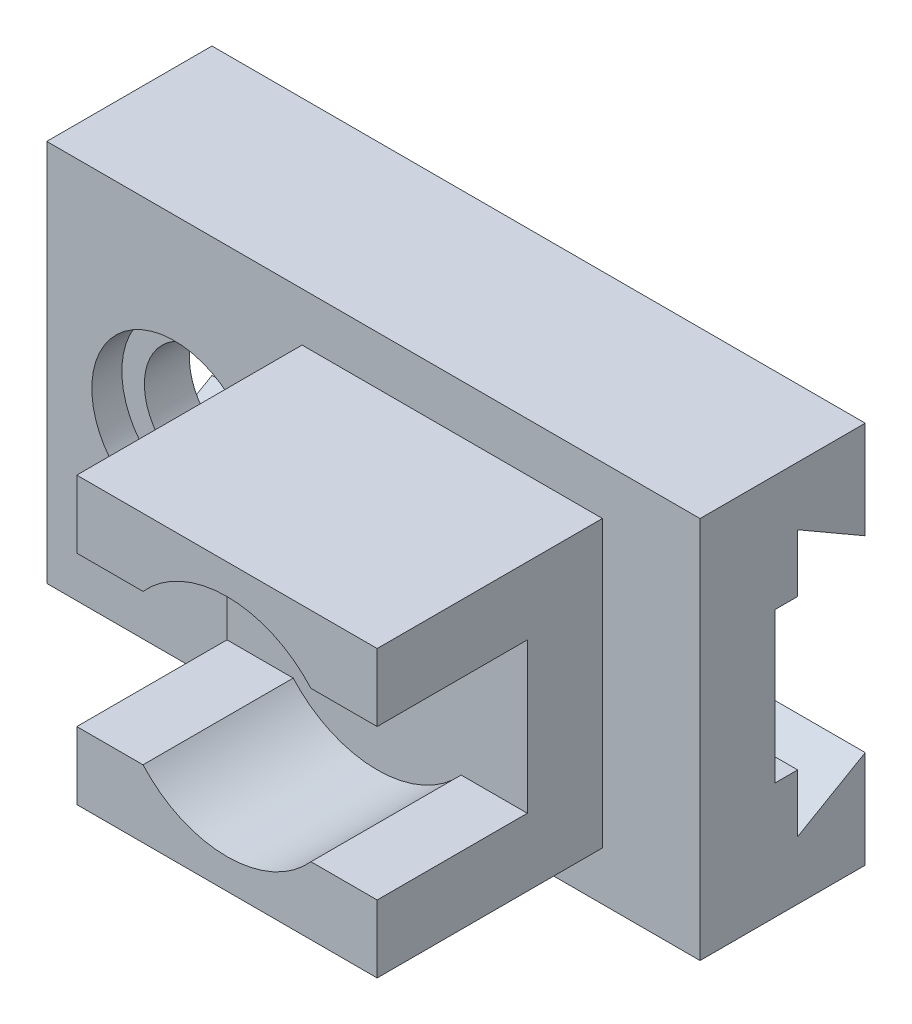
ISO-10303-21;
HEADER;
FILE_DESCRIPTION(('STEP AP214'),'2;1');
FILE_NAME('part.step','',(''),(''),'','','');
FILE_SCHEMA(('AUTOMOTIVE_DESIGN { 1 0 10303 214 1 1 1 1 }'));
ENDSEC;
DATA;
#1=APPLICATION_CONTEXT('core data for automotive mechanical design processes');
#2=APPLICATION_PROTOCOL_DEFINITION('international standard','automotive_design',2000,#1);
#3=PRODUCT_CONTEXT('',#1,'mechanical');
#4=PRODUCT('Part','Part','',(#3));
#5=PRODUCT_RELATED_PRODUCT_CATEGORY('part','',(#4));
#6=PRODUCT_DEFINITION_FORMATION('','',#4);
#7=PRODUCT_DEFINITION_CONTEXT('part definition',#1,'design');
#8=PRODUCT_DEFINITION('design','',#6,#7);
#9=PRODUCT_DEFINITION_SHAPE('','',#8);
#10=(LENGTH_UNIT() NAMED_UNIT(*) SI_UNIT(.MILLI.,.METRE.));
#11=(NAMED_UNIT(*) PLANE_ANGLE_UNIT() SI_UNIT($,.RADIAN.));
#12=(NAMED_UNIT(*) SI_UNIT($,.STERADIAN.) SOLID_ANGLE_UNIT());
#13=UNCERTAINTY_MEASURE_WITH_UNIT(LENGTH_MEASURE(1.E-05),#10,'distance_accuracy_value','');
#14=(GEOMETRIC_REPRESENTATION_CONTEXT(3) GLOBAL_UNCERTAINTY_ASSIGNED_CONTEXT((#13)) GLOBAL_UNIT_ASSIGNED_CONTEXT((#10,
#11,#12)) REPRESENTATION_CONTEXT('',''));
#15=CARTESIAN_POINT('',(0.,0.,0.));
#16=DIRECTION('',(0.,0.,1.));
#17=DIRECTION('',(1.,0.,0.));
#18=AXIS2_PLACEMENT_3D('',#15,#16,#17);
#19=CARTESIAN_POINT('',(0.,0.,-22.));
#20=DIRECTION('',(0.,0.,1.));
#21=DIRECTION('',(1.,0.,0.));
#22=AXIS2_PLACEMENT_3D('',#19,#20,#21);
#23=PLANE('',#22);
#24=DIRECTION('',(0.,-1.,0.));
#25=VECTOR('',#24,1.);
#26=CARTESIAN_POINT('',(-43.5,25.491,-22.));
#27=LINE('',#26,#25);
#28=CARTESIAN_POINT('',(-43.5,-12.5,-22.));
#29=VERTEX_POINT('',#28);
#30=CARTESIAN_POINT('',(-43.5,-25.491,-22.));
#31=VERTEX_POINT('',#30);
#32=EDGE_CURVE('E391',#29,#31,#27,.T.);
#33=ORIENTED_EDGE('',*,*,#32,.F.);
#34=DIRECTION('',(-1.,0.,0.));
#35=VECTOR('',#34,1.);
#36=CARTESIAN_POINT('',(43.5,-12.5,-22.));
#37=LINE('',#36,#35);
#38=CARTESIAN_POINT('',(43.5,-12.5,-22.));
#39=VERTEX_POINT('',#38);
#40=EDGE_CURVE('E292',#39,#29,#37,.T.);
#41=ORIENTED_EDGE('',*,*,#40,.F.);
#42=DIRECTION('',(0.,1.,0.));
#43=VECTOR('',#42,1.);
#44=CARTESIAN_POINT('',(43.5,-25.491,-22.));
#45=LINE('',#44,#43);
#46=CARTESIAN_POINT('',(43.5,-25.491,-22.));
#47=VERTEX_POINT('',#46);
#48=EDGE_CURVE('E400',#47,#39,#45,.T.);
#49=ORIENTED_EDGE('',*,*,#48,.F.);
#50=DIRECTION('',(1.,0.,0.));
#51=VECTOR('',#50,1.);
#52=CARTESIAN_POINT('',(-43.5,-25.491,-22.));
#53=LINE('',#52,#51);
#54=EDGE_CURVE('E396',#31,#47,#53,.T.);
#55=ORIENTED_EDGE('',*,*,#54,.F.);
#56=EDGE_LOOP('',(#33,#41,#49,#55));
#57=FACE_BOUND('',#56,.T.);
#58=ADVANCED_FACE('F69',(#57),#23,.F.);
#59=CARTESIAN_POINT('',(30.5,-19.,30.));
#60=DIRECTION('',(-1.,0.,0.));
#61=DIRECTION('',(0.,0.,1.));
#62=AXIS2_PLACEMENT_3D('',#59,#60,#61);
#63=PLANE('',#62);
#64=DIRECTION('',(0.,0.,1.));
#65=VECTOR('',#64,1.);
#66=CARTESIAN_POINT('',(30.5,9.99999999999999,10.));
#67=LINE('',#66,#65);
#68=CARTESIAN_POINT('',(30.5,9.99999999999999,10.));
#69=VERTEX_POINT('',#68);
#70=CARTESIAN_POINT('',(30.5,9.99999999999999,30.));
#71=VERTEX_POINT('',#70);
#72=EDGE_CURVE('E314',#69,#71,#67,.T.);
#73=ORIENTED_EDGE('',*,*,#72,.F.);
#74=DIRECTION('',(0.,1.,0.));
#75=VECTOR('',#74,1.);
#76=CARTESIAN_POINT('',(30.5,-9.99999999999999,10.));
#77=LINE('',#76,#75);
#78=CARTESIAN_POINT('',(30.5,-9.99999999999999,10.));
#79=VERTEX_POINT('',#78);
#80=EDGE_CURVE('E320',#79,#69,#77,.T.);
#81=ORIENTED_EDGE('',*,*,#80,.F.);
#82=DIRECTION('',(0.,0.,1.));
#83=VECTOR('',#82,1.);
#84=CARTESIAN_POINT('',(30.5,-9.99999999999999,10.));
#85=LINE('',#84,#83);
#86=CARTESIAN_POINT('',(30.5,-9.99999999999999,30.));
#87=VERTEX_POINT('',#86);
#88=EDGE_CURVE('E344',#79,#87,#85,.T.);
#89=ORIENTED_EDGE('',*,*,#88,.T.);
#90=DIRECTION('',(0.,1.,0.));
#91=VECTOR('',#90,1.);
#92=CARTESIAN_POINT('',(30.5,-19.,30.));
#93=LINE('',#92,#91);
#94=CARTESIAN_POINT('',(30.5,-19.,30.));
#95=VERTEX_POINT('',#94);
#96=EDGE_CURVE('E359',#95,#87,#93,.T.);
#97=ORIENTED_EDGE('',*,*,#96,.F.);
#98=DIRECTION('',(0.,0.,-1.));
#99=VECTOR('',#98,1.);
#100=CARTESIAN_POINT('',(30.5,-19.,30.));
#101=LINE('',#100,#99);
#102=CARTESIAN_POINT('',(30.5,-19.,0.));
#103=VERTEX_POINT('',#102);
#104=EDGE_CURVE('E373',#95,#103,#101,.T.);
#105=ORIENTED_EDGE('',*,*,#104,.T.);
#106=DIRECTION('',(0.,1.,0.));
#107=VECTOR('',#106,1.);
#108=CARTESIAN_POINT('',(30.5,-19.,0.));
#109=LINE('',#108,#107);
#110=CARTESIAN_POINT('',(30.5,19.,0.));
#111=VERTEX_POINT('',#110);
#112=EDGE_CURVE('E352',#103,#111,#109,.T.);
#113=ORIENTED_EDGE('',*,*,#112,.T.);
#114=DIRECTION('',(0.,0.,-1.));
#115=VECTOR('',#114,1.);
#116=CARTESIAN_POINT('',(30.5,19.,30.));
#117=LINE('',#116,#115);
#118=CARTESIAN_POINT('',(30.5,19.,30.));
#119=VERTEX_POINT('',#118);
#120=EDGE_CURVE('E362',#119,#111,#117,.T.);
#121=ORIENTED_EDGE('',*,*,#120,.F.);
#122=EDGE_CURVE('E358',#71,#119,#93,.T.);
#123=ORIENTED_EDGE('',*,*,#122,.F.);
#124=EDGE_LOOP('',(#73,#81,#89,#97,#105,#113,#121,#123));
#125=FACE_BOUND('',#124,.T.);
#126=ADVANCED_FACE('F481',(#125),#63,.F.);
#127=CARTESIAN_POINT('',(0.,0.,30.));
#128=DIRECTION('',(0.,0.,1.));
#129=DIRECTION('',(1.,0.,0.));
#130=AXIS2_PLACEMENT_3D('',#127,#128,#129);
#131=PLANE('',#130);
#132=CARTESIAN_POINT('',(10.5,0.,30.));
#133=DIRECTION('',(0.,0.,1.));
#134=DIRECTION('',(1.,0.,0.));
#135=AXIS2_PLACEMENT_3D('',#132,#133,#134);
#136=CIRCLE('',#135,15.);
#137=CARTESIAN_POINT('',(21.680339887499,9.99999999999999,30.));
#138=VERTEX_POINT('',#137);
#139=CARTESIAN_POINT('',(-0.680339887498955,9.99999999999999,30.));
#140=VERTEX_POINT('',#139);
#141=EDGE_CURVE('E94',#138,#140,#136,.T.);
#142=ORIENTED_EDGE('',*,*,#141,.F.);
#143=DIRECTION('',(1.,0.,0.));
#144=VECTOR('',#143,1.);
#145=CARTESIAN_POINT('',(-9.5,9.99999999999999,30.));
#146=LINE('',#145,#144);
#147=EDGE_CURVE('E336',#138,#71,#146,.T.);
#148=ORIENTED_EDGE('',*,*,#147,.T.);
#149=ORIENTED_EDGE('',*,*,#122,.T.);
#150=DIRECTION('',(-1.,0.,0.));
#151=VECTOR('',#150,1.);
#152=CARTESIAN_POINT('',(30.5,19.,30.));
#153=LINE('',#152,#151);
#154=CARTESIAN_POINT('',(-9.5,19.,30.));
#155=VERTEX_POINT('',#154);
#156=EDGE_CURVE('E348',#119,#155,#153,.T.);
#157=ORIENTED_EDGE('',*,*,#156,.T.);
#158=DIRECTION('',(0.,-1.,0.));
#159=VECTOR('',#158,1.);
#160=CARTESIAN_POINT('',(-9.5,19.,30.));
#161=LINE('',#160,#159);
#162=CARTESIAN_POINT('',(-9.5,9.99999999999999,30.));
#163=VERTEX_POINT('',#162);
#164=EDGE_CURVE('E353',#155,#163,#161,.T.);
#165=ORIENTED_EDGE('',*,*,#164,.T.);
#166=EDGE_CURVE('E332',#163,#140,#146,.T.);
#167=ORIENTED_EDGE('',*,*,#166,.T.);
#168=EDGE_LOOP('',(#142,#148,#149,#157,#165,#167));
#169=FACE_BOUND('',#168,.T.);
#170=ADVANCED_FACE('F438',(#169),#131,.T.);
#171=CARTESIAN_POINT('',(0.,0.,0.));
#172=DIRECTION('',(0.,0.,1.));
#173=DIRECTION('',(1.,0.,0.));
#174=AXIS2_PLACEMENT_3D('',#171,#172,#173);
#175=PLANE('',#174);
#176=CARTESIAN_POINT('',(-26.5,0.,0.));
#177=DIRECTION('',(0.,0.,1.));
#178=DIRECTION('',(1.,0.,0.));
#179=AXIS2_PLACEMENT_3D('',#176,#177,#178);
#180=CIRCLE('',#179,11.);
#181=CARTESIAN_POINT('',(-15.5,0.,0.));
#182=VERTEX_POINT('',#181);
#183=EDGE_CURVE('E385',#182,#182,#180,.T.);
#184=ORIENTED_EDGE('',*,*,#183,.F.);
#185=EDGE_LOOP('',(#184));
#186=FACE_BOUND('',#185,.T.);
#187=DIRECTION('',(-1.,0.,0.));
#188=VECTOR('',#187,1.);
#189=CARTESIAN_POINT('',(43.5,25.491,0.));
#190=LINE('',#189,#188);
#191=CARTESIAN_POINT('',(43.5,25.491,0.));
#192=VERTEX_POINT('',#191);
#193=CARTESIAN_POINT('',(-43.5,25.491,0.));
#194=VERTEX_POINT('',#193);
#195=EDGE_CURVE('E384',#192,#194,#190,.T.);
#196=ORIENTED_EDGE('',*,*,#195,.T.);
#197=DIRECTION('',(0.,-1.,0.));
#198=VECTOR('',#197,1.);
#199=CARTESIAN_POINT('',(-43.5,25.491,0.));
#200=LINE('',#199,#198);
#201=CARTESIAN_POINT('',(-43.5,-25.491,0.));
#202=VERTEX_POINT('',#201);
#203=EDGE_CURVE('E406',#194,#202,#200,.T.);
#204=ORIENTED_EDGE('',*,*,#203,.T.);
#205=DIRECTION('',(1.,0.,0.));
#206=VECTOR('',#205,1.);
#207=CARTESIAN_POINT('',(-43.5,-25.491,0.));
#208=LINE('',#207,#206);
#209=CARTESIAN_POINT('',(43.5,-25.491,0.));
#210=VERTEX_POINT('',#209);
#211=EDGE_CURVE('E409',#202,#210,#208,.T.);
#212=ORIENTED_EDGE('',*,*,#211,.T.);
#213=DIRECTION('',(0.,1.,0.));
#214=VECTOR('',#213,1.);
#215=CARTESIAN_POINT('',(43.5,-25.491,0.));
#216=LINE('',#215,#214);
#217=EDGE_CURVE('E392',#210,#192,#216,.T.);
#218=ORIENTED_EDGE('',*,*,#217,.T.);
#219=EDGE_LOOP('',(#196,#204,#212,#218));
#220=FACE_BOUND('',#219,.T.);
#221=DIRECTION('',(0.,-1.,0.));
#222=VECTOR('',#221,1.);
#223=CARTESIAN_POINT('',(-9.5,19.,0.));
#224=LINE('',#223,#222);
#225=CARTESIAN_POINT('',(-9.5,19.,0.));
#226=VERTEX_POINT('',#225);
#227=CARTESIAN_POINT('',(-9.5,-19.,0.));
#228=VERTEX_POINT('',#227);
#229=EDGE_CURVE('E365',#226,#228,#224,.T.);
#230=ORIENTED_EDGE('',*,*,#229,.F.);
#231=DIRECTION('',(-1.,0.,0.));
#232=VECTOR('',#231,1.);
#233=CARTESIAN_POINT('',(30.5,19.,0.));
#234=LINE('',#233,#232);
#235=EDGE_CURVE('E305',#111,#226,#234,.T.);
#236=ORIENTED_EDGE('',*,*,#235,.F.);
#237=ORIENTED_EDGE('',*,*,#112,.F.);
#238=DIRECTION('',(1.,0.,0.));
#239=VECTOR('',#238,1.);
#240=CARTESIAN_POINT('',(-9.5,-19.,0.));
#241=LINE('',#240,#239);
#242=EDGE_CURVE('E367',#228,#103,#241,.T.);
#243=ORIENTED_EDGE('',*,*,#242,.F.);
#244=EDGE_LOOP('',(#230,#236,#237,#243));
#245=FACE_BOUND('',#244,.T.);
#246=ADVANCED_FACE('F435',(#186,#220,#245),#175,.T.);
#247=CARTESIAN_POINT('',(43.5,25.491,-22.));
#248=DIRECTION('',(0.,1.,0.));
#249=DIRECTION('',(-1.,0.,0.));
#250=AXIS2_PLACEMENT_3D('',#247,#248,#249);
#251=PLANE('',#250);
#252=ORIENTED_EDGE('',*,*,#195,.F.);
#253=DIRECTION('',(0.,0.,1.));
#254=VECTOR('',#253,1.);
#255=CARTESIAN_POINT('',(43.5,25.491,-22.));
#256=LINE('',#255,#254);
#257=CARTESIAN_POINT('',(43.5,25.491,-22.));
#258=VERTEX_POINT('',#257);
#259=EDGE_CURVE('E12',#258,#192,#256,.T.);
#260=ORIENTED_EDGE('',*,*,#259,.F.);
#261=DIRECTION('',(-1.,0.,0.));
#262=VECTOR('',#261,1.);
#263=CARTESIAN_POINT('',(43.5,25.491,-22.));
#264=LINE('',#263,#262);
#265=CARTESIAN_POINT('',(-43.5,25.491,-22.));
#266=VERTEX_POINT('',#265);
#267=EDGE_CURVE('E388',#258,#266,#264,.T.);
#268=ORIENTED_EDGE('',*,*,#267,.T.);
#269=DIRECTION('',(0.,0.,1.));
#270=VECTOR('',#269,1.);
#271=CARTESIAN_POINT('',(-43.5,25.491,-22.));
#272=LINE('',#271,#270);
#273=EDGE_CURVE('E403',#266,#194,#272,.T.);
#274=ORIENTED_EDGE('',*,*,#273,.T.);
#275=EDGE_LOOP('',(#252,#260,#268,#274));
#276=FACE_BOUND('',#275,.T.);
#277=ADVANCED_FACE('F71',(#276),#251,.T.);
#278=CARTESIAN_POINT('',(43.5,-25.491,-22.));
#279=DIRECTION('',(1.,0.,0.));
#280=DIRECTION('',(0.,1.,0.));
#281=AXIS2_PLACEMENT_3D('',#278,#279,#280);
#282=PLANE('',#281);
#283=DIRECTION('',(0.,-0.500000000000002,0.866025403784438));
#284=VECTOR('',#283,1.);
#285=CARTESIAN_POINT('',(43.5,-17.6961524227067,-13.));
#286=LINE('',#285,#284);
#287=CARTESIAN_POINT('',(43.5,-17.6961524227067,-13.));
#288=VERTEX_POINT('',#287);
#289=EDGE_CURVE('E264',#39,#288,#286,.T.);
#290=ORIENTED_EDGE('',*,*,#289,.T.);
#291=DIRECTION('',(0.,1.,0.));
#292=VECTOR('',#291,1.);
#293=CARTESIAN_POINT('',(43.5,-10.,-13.));
#294=LINE('',#293,#292);
#295=CARTESIAN_POINT('',(43.5,-10.,-13.));
#296=VERTEX_POINT('',#295);
#297=EDGE_CURVE('E266',#288,#296,#294,.T.);
#298=ORIENTED_EDGE('',*,*,#297,.T.);
#299=DIRECTION('',(0.,0.,1.));
#300=VECTOR('',#299,1.);
#301=CARTESIAN_POINT('',(43.5,-10.,-10.));
#302=LINE('',#301,#300);
#303=CARTESIAN_POINT('',(43.5,-10.,-10.));
#304=VERTEX_POINT('',#303);
#305=EDGE_CURVE('E269',#296,#304,#302,.T.);
#306=ORIENTED_EDGE('',*,*,#305,.T.);
#307=DIRECTION('',(0.,1.,0.));
#308=VECTOR('',#307,1.);
#309=CARTESIAN_POINT('',(43.5,10.,-10.));
#310=LINE('',#309,#308);
#311=CARTESIAN_POINT('',(43.5,10.,-10.));
#312=VERTEX_POINT('',#311);
#313=EDGE_CURVE('E243',#304,#312,#310,.T.);
#314=ORIENTED_EDGE('',*,*,#313,.T.);
#315=DIRECTION('',(0.,0.,-1.));
#316=VECTOR('',#315,1.);
#317=CARTESIAN_POINT('',(43.5,10.,-10.));
#318=LINE('',#317,#316);
#319=CARTESIAN_POINT('',(43.5,10.,-13.));
#320=VERTEX_POINT('',#319);
#321=EDGE_CURVE('E235',#312,#320,#318,.T.);
#322=ORIENTED_EDGE('',*,*,#321,.T.);
#323=DIRECTION('',(0.,1.,0.));
#324=VECTOR('',#323,1.);
#325=CARTESIAN_POINT('',(43.5,10.,-13.));
#326=LINE('',#325,#324);
#327=CARTESIAN_POINT('',(43.5,17.6961524227067,-13.));
#328=VERTEX_POINT('',#327);
#329=EDGE_CURVE('E246',#320,#328,#326,.T.);
#330=ORIENTED_EDGE('',*,*,#329,.T.);
#331=DIRECTION('',(0.,-0.500000000000002,-0.866025403784438));
#332=VECTOR('',#331,1.);
#333=CARTESIAN_POINT('',(43.5,17.6961524227067,-13.));
#334=LINE('',#333,#332);
#335=CARTESIAN_POINT('',(43.5,12.5,-22.));
#336=VERTEX_POINT('',#335);
#337=EDGE_CURVE('E251',#328,#336,#334,.T.);
#338=ORIENTED_EDGE('',*,*,#337,.T.);
#339=EDGE_CURVE('E399',#336,#258,#45,.T.);
#340=ORIENTED_EDGE('',*,*,#339,.T.);
#341=ORIENTED_EDGE('',*,*,#259,.T.);
#342=ORIENTED_EDGE('',*,*,#217,.F.);
#343=DIRECTION('',(0.,0.,1.));
#344=VECTOR('',#343,1.);
#345=CARTESIAN_POINT('',(43.5,-25.491,-22.));
#346=LINE('',#345,#344);
#347=EDGE_CURVE('E78',#47,#210,#346,.T.);
#348=ORIENTED_EDGE('',*,*,#347,.F.);
#349=ORIENTED_EDGE('',*,*,#48,.T.);
#350=EDGE_LOOP('',(#290,#298,#306,#314,#322,#330,#338,#340,#341,#342,#348,#349));
#351=FACE_BOUND('',#350,.T.);
#352=ADVANCED_FACE('F254',(#351),#282,.T.);
#353=CARTESIAN_POINT('',(-43.5,-25.491,-22.));
#354=DIRECTION('',(0.,-1.,0.));
#355=DIRECTION('',(1.,0.,0.));
#356=AXIS2_PLACEMENT_3D('',#353,#354,#355);
#357=PLANE('',#356);
#358=ORIENTED_EDGE('',*,*,#211,.F.);
#359=DIRECTION('',(0.,0.,1.));
#360=VECTOR('',#359,1.);
#361=CARTESIAN_POINT('',(-43.5,-25.491,-22.));
#362=LINE('',#361,#360);
#363=EDGE_CURVE('E415',#31,#202,#362,.T.);
#364=ORIENTED_EDGE('',*,*,#363,.F.);
#365=ORIENTED_EDGE('',*,*,#54,.T.);
#366=ORIENTED_EDGE('',*,*,#347,.T.);
#367=EDGE_LOOP('',(#358,#364,#365,#366));
#368=FACE_BOUND('',#367,.T.);
#369=ADVANCED_FACE('F522',(#368),#357,.T.);
#370=CARTESIAN_POINT('',(-43.5,25.491,-22.));
#371=DIRECTION('',(-1.,0.,0.));
#372=DIRECTION('',(0.,0.,1.));
#373=AXIS2_PLACEMENT_3D('',#370,#371,#372);
#374=PLANE('',#373);
#375=DIRECTION('',(0.,-0.500000000000002,0.866025403784438));
#376=VECTOR('',#375,1.);
#377=CARTESIAN_POINT('',(-43.5,-17.6961524227067,-13.));
#378=LINE('',#377,#376);
#379=CARTESIAN_POINT('',(-43.5,-17.6961524227067,-13.));
#380=VERTEX_POINT('',#379);
#381=EDGE_CURVE('E276',#29,#380,#378,.T.);
#382=ORIENTED_EDGE('',*,*,#381,.F.);
#383=ORIENTED_EDGE('',*,*,#32,.T.);
#384=ORIENTED_EDGE('',*,*,#363,.T.);
#385=ORIENTED_EDGE('',*,*,#203,.F.);
#386=ORIENTED_EDGE('',*,*,#273,.F.);
#387=CARTESIAN_POINT('',(-43.5,12.5,-22.));
#388=VERTEX_POINT('',#387);
#389=EDGE_CURVE('E393',#266,#388,#27,.T.);
#390=ORIENTED_EDGE('',*,*,#389,.T.);
#391=DIRECTION('',(0.,-0.500000000000002,-0.866025403784438));
#392=VECTOR('',#391,1.);
#393=CARTESIAN_POINT('',(-43.5,17.6961524227067,-13.));
#394=LINE('',#393,#392);
#395=CARTESIAN_POINT('',(-43.5,17.6961524227067,-13.));
#396=VERTEX_POINT('',#395);
#397=EDGE_CURVE('E86',#396,#388,#394,.T.);
#398=ORIENTED_EDGE('',*,*,#397,.F.);
#399=DIRECTION('',(0.,1.,0.));
#400=VECTOR('',#399,1.);
#401=CARTESIAN_POINT('',(-43.5,10.,-13.));
#402=LINE('',#401,#400);
#403=CARTESIAN_POINT('',(-43.5,10.,-13.));
#404=VERTEX_POINT('',#403);
#405=EDGE_CURVE('E273',#404,#396,#402,.T.);
#406=ORIENTED_EDGE('',*,*,#405,.F.);
#407=DIRECTION('',(0.,0.,-1.));
#408=VECTOR('',#407,1.);
#409=CARTESIAN_POINT('',(-43.5,10.,-10.));
#410=LINE('',#409,#408);
#411=CARTESIAN_POINT('',(-43.5,10.,-10.));
#412=VERTEX_POINT('',#411);
#413=EDGE_CURVE('E238',#412,#404,#410,.T.);
#414=ORIENTED_EDGE('',*,*,#413,.F.);
#415=DIRECTION('',(0.,1.,0.));
#416=VECTOR('',#415,1.);
#417=CARTESIAN_POINT('',(-43.5,10.,-10.));
#418=LINE('',#417,#416);
#419=CARTESIAN_POINT('',(-43.5,-10.,-10.));
#420=VERTEX_POINT('',#419);
#421=EDGE_CURVE('E257',#420,#412,#418,.T.);
#422=ORIENTED_EDGE('',*,*,#421,.F.);
#423=DIRECTION('',(0.,0.,1.));
#424=VECTOR('',#423,1.);
#425=CARTESIAN_POINT('',(-43.5,-10.,-10.));
#426=LINE('',#425,#424);
#427=CARTESIAN_POINT('',(-43.5,-10.,-13.));
#428=VERTEX_POINT('',#427);
#429=EDGE_CURVE('E260',#428,#420,#426,.T.);
#430=ORIENTED_EDGE('',*,*,#429,.F.);
#431=DIRECTION('',(0.,1.,0.));
#432=VECTOR('',#431,1.);
#433=CARTESIAN_POINT('',(-43.5,-10.,-13.));
#434=LINE('',#433,#432);
#435=EDGE_CURVE('E279',#380,#428,#434,.T.);
#436=ORIENTED_EDGE('',*,*,#435,.F.);
#437=EDGE_LOOP('',(#382,#383,#384,#385,#386,#390,#398,#406,#414,#422,#430,#436));
#438=FACE_BOUND('',#437,.T.);
#439=ADVANCED_FACE('F517',(#438),#374,.T.);
#440=ORIENTED_EDGE('',*,*,#339,.F.);
#441=DIRECTION('',(-1.,0.,0.));
#442=VECTOR('',#441,1.);
#443=CARTESIAN_POINT('',(43.5,12.5,-22.));
#444=LINE('',#443,#442);
#445=EDGE_CURVE('E294',#336,#388,#444,.T.);
#446=ORIENTED_EDGE('',*,*,#445,.T.);
#447=ORIENTED_EDGE('',*,*,#389,.F.);
#448=ORIENTED_EDGE('',*,*,#267,.F.);
#449=EDGE_LOOP('',(#440,#446,#447,#448));
#450=FACE_BOUND('',#449,.T.);
#451=ADVANCED_FACE('F431',(#450),#23,.F.);
#452=CARTESIAN_POINT('',(-26.5,0.,-4.));
#453=DIRECTION('',(0.,0.,1.));
#454=DIRECTION('',(1.,0.,0.));
#455=AXIS2_PLACEMENT_3D('',#452,#453,#454);
#456=CYLINDRICAL_SURFACE('',#455,11.);
#457=CARTESIAN_POINT('',(-26.5,0.,-4.));
#458=DIRECTION('',(0.,0.,1.));
#459=DIRECTION('',(1.,0.,0.));
#460=AXIS2_PLACEMENT_3D('',#457,#458,#459);
#461=CIRCLE('',#460,11.);
#462=CARTESIAN_POINT('',(-15.5,0.,-4.));
#463=VERTEX_POINT('',#462);
#464=EDGE_CURVE('E381',#463,#463,#461,.T.);
#465=ORIENTED_EDGE('',*,*,#464,.F.);
#466=EDGE_LOOP('',(#465));
#467=FACE_BOUND('',#466,.T.);
#468=ORIENTED_EDGE('',*,*,#183,.T.);
#469=EDGE_LOOP('',(#468));
#470=FACE_BOUND('',#469,.T.);
#471=ADVANCED_FACE('F425',(#467,#470),#456,.F.);
#472=CARTESIAN_POINT('',(-26.5,0.,-4.));
#473=DIRECTION('',(0.,0.,1.));
#474=DIRECTION('',(1.,0.,0.));
#475=AXIS2_PLACEMENT_3D('',#472,#473,#474);
#476=PLANE('',#475);
#477=CARTESIAN_POINT('',(-26.5,0.,-4.));
#478=DIRECTION('',(0.,0.,1.));
#479=DIRECTION('',(1.,0.,0.));
#480=AXIS2_PLACEMENT_3D('',#477,#478,#479);
#481=CIRCLE('',#480,8.);
#482=CARTESIAN_POINT('',(-18.5,0.,-4.));
#483=VERTEX_POINT('',#482);
#484=EDGE_CURVE('E380',#483,#483,#481,.T.);
#485=ORIENTED_EDGE('',*,*,#484,.F.);
#486=EDGE_LOOP('',(#485));
#487=FACE_BOUND('',#486,.T.);
#488=ORIENTED_EDGE('',*,*,#464,.T.);
#489=EDGE_LOOP('',(#488));
#490=FACE_BOUND('',#489,.T.);
#491=ADVANCED_FACE('F422',(#487,#490),#476,.T.);
#492=CARTESIAN_POINT('',(-26.5,0.,-22.));
#493=DIRECTION('',(0.,0.,1.));
#494=DIRECTION('',(1.,0.,0.));
#495=AXIS2_PLACEMENT_3D('',#492,#493,#494);
#496=CYLINDRICAL_SURFACE('',#495,8.);
#497=CARTESIAN_POINT('',(-26.5,0.,-10.));
#498=DIRECTION('',(0.,0.,1.));
#499=DIRECTION('',(1.,0.,0.));
#500=AXIS2_PLACEMENT_3D('',#497,#498,#499);
#501=CIRCLE('',#500,8.);
#502=CARTESIAN_POINT('',(-18.5,0.,-10.));
#503=VERTEX_POINT('',#502);
#504=EDGE_CURVE('E73',#503,#503,#501,.F.);
#505=ORIENTED_EDGE('',*,*,#504,.T.);
#506=EDGE_LOOP('',(#505));
#507=FACE_BOUND('',#506,.T.);
#508=ORIENTED_EDGE('',*,*,#484,.T.);
#509=EDGE_LOOP('',(#508));
#510=FACE_BOUND('',#509,.T.);
#511=ADVANCED_FACE('F420',(#507,#510),#496,.F.);
#512=CARTESIAN_POINT('',(30.5,19.,30.));
#513=DIRECTION('',(0.,-1.,0.));
#514=DIRECTION('',(0.,0.,-1.));
#515=AXIS2_PLACEMENT_3D('',#512,#513,#514);
#516=PLANE('',#515);
#517=ORIENTED_EDGE('',*,*,#235,.T.);
#518=DIRECTION('',(0.,0.,-1.));
#519=VECTOR('',#518,1.);
#520=CARTESIAN_POINT('',(-9.5,19.,30.));
#521=LINE('',#520,#519);
#522=EDGE_CURVE('E378',#155,#226,#521,.T.);
#523=ORIENTED_EDGE('',*,*,#522,.F.);
#524=ORIENTED_EDGE('',*,*,#156,.F.);
#525=ORIENTED_EDGE('',*,*,#120,.T.);
#526=EDGE_LOOP('',(#517,#523,#524,#525));
#527=FACE_BOUND('',#526,.T.);
#528=ADVANCED_FACE('F574',(#527),#516,.F.);
#529=CARTESIAN_POINT('',(-9.5,19.,30.));
#530=DIRECTION('',(1.,0.,0.));
#531=DIRECTION('',(0.,0.,-1.));
#532=AXIS2_PLACEMENT_3D('',#529,#530,#531);
#533=PLANE('',#532);
#534=CARTESIAN_POINT('',(-9.5,-10.,30.));
#535=VERTEX_POINT('',#534);
#536=CARTESIAN_POINT('',(-9.5,-19.,30.));
#537=VERTEX_POINT('',#536);
#538=EDGE_CURVE('E351',#535,#537,#161,.T.);
#539=ORIENTED_EDGE('',*,*,#538,.F.);
#540=DIRECTION('',(0.,0.,1.));
#541=VECTOR('',#540,1.);
#542=CARTESIAN_POINT('',(-9.5,-10.,10.));
#543=LINE('',#542,#541);
#544=CARTESIAN_POINT('',(-9.5,-10.,10.));
#545=VERTEX_POINT('',#544);
#546=EDGE_CURVE('E342',#545,#535,#543,.T.);
#547=ORIENTED_EDGE('',*,*,#546,.F.);
#548=DIRECTION('',(0.,1.,0.));
#549=VECTOR('',#548,1.);
#550=CARTESIAN_POINT('',(-9.5,-10.,10.));
#551=LINE('',#550,#549);
#552=CARTESIAN_POINT('',(-9.5,9.99999999999999,10.));
#553=VERTEX_POINT('',#552);
#554=EDGE_CURVE('E328',#545,#553,#551,.T.);
#555=ORIENTED_EDGE('',*,*,#554,.T.);
#556=DIRECTION('',(0.,0.,1.));
#557=VECTOR('',#556,1.);
#558=CARTESIAN_POINT('',(-9.5,9.99999999999999,10.));
#559=LINE('',#558,#557);
#560=EDGE_CURVE('E331',#553,#163,#559,.T.);
#561=ORIENTED_EDGE('',*,*,#560,.T.);
#562=ORIENTED_EDGE('',*,*,#164,.F.);
#563=ORIENTED_EDGE('',*,*,#522,.T.);
#564=ORIENTED_EDGE('',*,*,#229,.T.);
#565=DIRECTION('',(0.,0.,-1.));
#566=VECTOR('',#565,1.);
#567=CARTESIAN_POINT('',(-9.5,-19.,30.));
#568=LINE('',#567,#566);
#569=EDGE_CURVE('E375',#537,#228,#568,.T.);
#570=ORIENTED_EDGE('',*,*,#569,.F.);
#571=EDGE_LOOP('',(#539,#547,#555,#561,#562,#563,#564,#570));
#572=FACE_BOUND('',#571,.T.);
#573=ADVANCED_FACE('F449',(#572),#533,.F.);
#574=CARTESIAN_POINT('',(-9.5,-19.,30.));
#575=DIRECTION('',(0.,1.,0.));
#576=DIRECTION('',(0.,0.,1.));
#577=AXIS2_PLACEMENT_3D('',#574,#575,#576);
#578=PLANE('',#577);
#579=ORIENTED_EDGE('',*,*,#242,.T.);
#580=ORIENTED_EDGE('',*,*,#104,.F.);
#581=DIRECTION('',(1.,0.,0.));
#582=VECTOR('',#581,1.);
#583=CARTESIAN_POINT('',(-9.5,-19.,30.));
#584=LINE('',#583,#582);
#585=EDGE_CURVE('E356',#537,#95,#584,.T.);
#586=ORIENTED_EDGE('',*,*,#585,.F.);
#587=ORIENTED_EDGE('',*,*,#569,.T.);
#588=EDGE_LOOP('',(#579,#580,#586,#587));
#589=FACE_BOUND('',#588,.T.);
#590=ADVANCED_FACE('F453',(#589),#578,.F.);
#591=DIRECTION('',(1.,0.,0.));
#592=VECTOR('',#591,1.);
#593=CARTESIAN_POINT('',(-9.5,-10.,30.));
#594=LINE('',#593,#592);
#595=CARTESIAN_POINT('',(21.680339887499,-10.,30.));
#596=VERTEX_POINT('',#595);
#597=EDGE_CURVE('E335',#596,#87,#594,.T.);
#598=ORIENTED_EDGE('',*,*,#597,.F.);
#599=CARTESIAN_POINT('',(10.5,0.,30.));
#600=DIRECTION('',(0.,0.,1.));
#601=DIRECTION('',(1.,0.,0.));
#602=AXIS2_PLACEMENT_3D('',#599,#600,#601);
#603=CIRCLE('',#602,15.);
#604=CARTESIAN_POINT('',(-0.680339887498943,-10.,30.));
#605=VERTEX_POINT('',#604);
#606=EDGE_CURVE('E311',#605,#596,#603,.T.);
#607=ORIENTED_EDGE('',*,*,#606,.F.);
#608=EDGE_CURVE('E337',#535,#605,#594,.T.);
#609=ORIENTED_EDGE('',*,*,#608,.F.);
#610=ORIENTED_EDGE('',*,*,#538,.T.);
#611=ORIENTED_EDGE('',*,*,#585,.T.);
#612=ORIENTED_EDGE('',*,*,#96,.T.);
#613=EDGE_LOOP('',(#598,#607,#609,#610,#611,#612));
#614=FACE_BOUND('',#613,.T.);
#615=ADVANCED_FACE('F458',(#614),#131,.T.);
#616=CARTESIAN_POINT('',(10.5,0.,10.));
#617=DIRECTION('',(0.,0.,1.));
#618=DIRECTION('',(1.,0.,0.));
#619=AXIS2_PLACEMENT_3D('',#616,#617,#618);
#620=CYLINDRICAL_SURFACE('',#619,15.);
#621=ORIENTED_EDGE('',*,*,#141,.T.);
#622=DIRECTION('',(0.,0.,1.));
#623=VECTOR('',#622,1.);
#624=CARTESIAN_POINT('',(-0.680339887498955,9.99999999999999,10.));
#625=LINE('',#624,#623);
#626=CARTESIAN_POINT('',(-0.680339887498955,9.99999999999999,10.));
#627=VERTEX_POINT('',#626);
#628=EDGE_CURVE('E303',#627,#140,#625,.T.);
#629=ORIENTED_EDGE('',*,*,#628,.F.);
#630=CARTESIAN_POINT('',(10.5,0.,10.));
#631=DIRECTION('',(0.,0.,1.));
#632=DIRECTION('',(1.,0.,0.));
#633=AXIS2_PLACEMENT_3D('',#630,#631,#632);
#634=CIRCLE('',#633,15.);
#635=CARTESIAN_POINT('',(21.680339887499,9.99999999999999,10.));
#636=VERTEX_POINT('',#635);
#637=EDGE_CURVE('E297',#636,#627,#634,.T.);
#638=ORIENTED_EDGE('',*,*,#637,.F.);
#639=DIRECTION('',(0.,0.,1.));
#640=VECTOR('',#639,1.);
#641=CARTESIAN_POINT('',(21.680339887499,9.99999999999999,10.));
#642=LINE('',#641,#640);
#643=EDGE_CURVE('E300',#636,#138,#642,.T.);
#644=ORIENTED_EDGE('',*,*,#643,.T.);
#645=EDGE_LOOP('',(#621,#629,#638,#644));
#646=FACE_BOUND('',#645,.T.);
#647=ADVANCED_FACE('F563',(#646),#620,.F.);
#648=CARTESIAN_POINT('',(0.,0.,10.));
#649=DIRECTION('',(0.,0.,1.));
#650=DIRECTION('',(1.,0.,0.));
#651=AXIS2_PLACEMENT_3D('',#648,#649,#650);
#652=PLANE('',#651);
#653=ORIENTED_EDGE('',*,*,#637,.T.);
#654=DIRECTION('',(1.,0.,0.));
#655=VECTOR('',#654,1.);
#656=CARTESIAN_POINT('',(-9.5,9.99999999999999,10.));
#657=LINE('',#656,#655);
#658=EDGE_CURVE('E317',#553,#627,#657,.T.);
#659=ORIENTED_EDGE('',*,*,#658,.F.);
#660=ORIENTED_EDGE('',*,*,#554,.F.);
#661=DIRECTION('',(1.,0.,0.));
#662=VECTOR('',#661,1.);
#663=CARTESIAN_POINT('',(-9.5,-10.,10.));
#664=LINE('',#663,#662);
#665=CARTESIAN_POINT('',(-0.680339887498943,-10.,10.));
#666=VERTEX_POINT('',#665);
#667=EDGE_CURVE('E325',#545,#666,#664,.T.);
#668=ORIENTED_EDGE('',*,*,#667,.T.);
#669=CARTESIAN_POINT('',(10.5,0.,10.));
#670=DIRECTION('',(0.,0.,1.));
#671=DIRECTION('',(1.,0.,0.));
#672=AXIS2_PLACEMENT_3D('',#669,#670,#671);
#673=CIRCLE('',#672,15.);
#674=CARTESIAN_POINT('',(21.680339887499,-10.,10.));
#675=VERTEX_POINT('',#674);
#676=EDGE_CURVE('E307',#666,#675,#673,.T.);
#677=ORIENTED_EDGE('',*,*,#676,.T.);
#678=EDGE_CURVE('E324',#675,#79,#664,.T.);
#679=ORIENTED_EDGE('',*,*,#678,.T.);
#680=ORIENTED_EDGE('',*,*,#80,.T.);
#681=EDGE_CURVE('E321',#636,#69,#657,.T.);
#682=ORIENTED_EDGE('',*,*,#681,.F.);
#683=EDGE_LOOP('',(#653,#659,#660,#668,#677,#679,#680,#682));
#684=FACE_BOUND('',#683,.T.);
#685=ADVANCED_FACE('F467',(#684),#652,.T.);
#686=CARTESIAN_POINT('',(10.5,0.,10.));
#687=DIRECTION('',(0.,0.,1.));
#688=DIRECTION('',(1.,0.,0.));
#689=AXIS2_PLACEMENT_3D('',#686,#687,#688);
#690=CYLINDRICAL_SURFACE('',#689,15.);
#691=ORIENTED_EDGE('',*,*,#606,.T.);
#692=DIRECTION('',(0.,0.,1.));
#693=VECTOR('',#692,1.);
#694=CARTESIAN_POINT('',(21.680339887499,-10.,10.));
#695=LINE('',#694,#693);
#696=EDGE_CURVE('E302',#675,#596,#695,.T.);
#697=ORIENTED_EDGE('',*,*,#696,.F.);
#698=ORIENTED_EDGE('',*,*,#676,.F.);
#699=DIRECTION('',(0.,0.,1.));
#700=VECTOR('',#699,1.);
#701=CARTESIAN_POINT('',(-0.680339887498943,-10.,10.));
#702=LINE('',#701,#700);
#703=EDGE_CURVE('E310',#666,#605,#702,.T.);
#704=ORIENTED_EDGE('',*,*,#703,.T.);
#705=EDGE_LOOP('',(#691,#697,#698,#704));
#706=FACE_BOUND('',#705,.T.);
#707=ADVANCED_FACE('F470',(#706),#690,.F.);
#708=CARTESIAN_POINT('',(-9.5,9.99999999999999,10.));
#709=DIRECTION('',(0.,-1.,0.));
#710=DIRECTION('',(1.,0.,0.));
#711=AXIS2_PLACEMENT_3D('',#708,#709,#710);
#712=PLANE('',#711);
#713=ORIENTED_EDGE('',*,*,#643,.F.);
#714=ORIENTED_EDGE('',*,*,#681,.T.);
#715=ORIENTED_EDGE('',*,*,#72,.T.);
#716=ORIENTED_EDGE('',*,*,#147,.F.);
#717=EDGE_LOOP('',(#713,#714,#715,#716));
#718=FACE_BOUND('',#717,.T.);
#719=ADVANCED_FACE('F486',(#718),#712,.T.);
#720=CARTESIAN_POINT('',(-9.5,-10.,10.));
#721=DIRECTION('',(0.,-1.,0.));
#722=DIRECTION('',(1.,0.,0.));
#723=AXIS2_PLACEMENT_3D('',#720,#721,#722);
#724=PLANE('',#723);
#725=ORIENTED_EDGE('',*,*,#597,.T.);
#726=ORIENTED_EDGE('',*,*,#88,.F.);
#727=ORIENTED_EDGE('',*,*,#678,.F.);
#728=ORIENTED_EDGE('',*,*,#696,.T.);
#729=EDGE_LOOP('',(#725,#726,#727,#728));
#730=FACE_BOUND('',#729,.T.);
#731=ADVANCED_FACE('F474',(#730),#724,.F.);
#732=ORIENTED_EDGE('',*,*,#667,.F.);
#733=ORIENTED_EDGE('',*,*,#546,.T.);
#734=ORIENTED_EDGE('',*,*,#608,.T.);
#735=ORIENTED_EDGE('',*,*,#703,.F.);
#736=EDGE_LOOP('',(#732,#733,#734,#735));
#737=FACE_BOUND('',#736,.T.);
#738=ADVANCED_FACE('F464',(#737),#724,.F.);
#739=ORIENTED_EDGE('',*,*,#628,.T.);
#740=ORIENTED_EDGE('',*,*,#166,.F.);
#741=ORIENTED_EDGE('',*,*,#560,.F.);
#742=ORIENTED_EDGE('',*,*,#658,.T.);
#743=EDGE_LOOP('',(#739,#740,#741,#742));
#744=FACE_BOUND('',#743,.T.);
#745=ADVANCED_FACE('F494',(#744),#712,.T.);
#746=CARTESIAN_POINT('',(43.5,10.,-10.));
#747=DIRECTION('',(0.,0.,1.));
#748=DIRECTION('',(1.,0.,0.));
#749=AXIS2_PLACEMENT_3D('',#746,#747,#748);
#750=PLANE('',#749);
#751=ORIENTED_EDGE('',*,*,#421,.T.);
#752=DIRECTION('',(-1.,0.,0.));
#753=VECTOR('',#752,1.);
#754=CARTESIAN_POINT('',(43.5,10.,-10.));
#755=LINE('',#754,#753);
#756=EDGE_CURVE('E284',#312,#412,#755,.T.);
#757=ORIENTED_EDGE('',*,*,#756,.F.);
#758=ORIENTED_EDGE('',*,*,#313,.F.);
#759=DIRECTION('',(-1.,0.,0.));
#760=VECTOR('',#759,1.);
#761=CARTESIAN_POINT('',(43.5,-10.,-10.));
#762=LINE('',#761,#760);
#763=EDGE_CURVE('E286',#304,#420,#762,.T.);
#764=ORIENTED_EDGE('',*,*,#763,.T.);
#765=EDGE_LOOP('',(#751,#757,#758,#764));
#766=FACE_BOUND('',#765,.T.);
#767=ORIENTED_EDGE('',*,*,#504,.F.);
#768=EDGE_LOOP('',(#767));
#769=FACE_BOUND('',#768,.T.);
#770=ADVANCED_FACE('F492',(#766,#769),#750,.F.);
#771=CARTESIAN_POINT('',(43.5,10.,-10.));
#772=DIRECTION('',(0.,1.,0.));
#773=DIRECTION('',(0.,0.,1.));
#774=AXIS2_PLACEMENT_3D('',#771,#772,#773);
#775=PLANE('',#774);
#776=ORIENTED_EDGE('',*,*,#413,.T.);
#777=DIRECTION('',(-1.,0.,0.));
#778=VECTOR('',#777,1.);
#779=CARTESIAN_POINT('',(43.5,10.,-13.));
#780=LINE('',#779,#778);
#781=EDGE_CURVE('E231',#320,#404,#780,.T.);
#782=ORIENTED_EDGE('',*,*,#781,.F.);
#783=ORIENTED_EDGE('',*,*,#321,.F.);
#784=ORIENTED_EDGE('',*,*,#756,.T.);
#785=EDGE_LOOP('',(#776,#782,#783,#784));
#786=FACE_BOUND('',#785,.T.);
#787=ADVANCED_FACE('F233',(#786),#775,.F.);
#788=CARTESIAN_POINT('',(43.5,-10.,-10.));
#789=DIRECTION('',(0.,-1.,0.));
#790=DIRECTION('',(0.,0.,-1.));
#791=AXIS2_PLACEMENT_3D('',#788,#789,#790);
#792=PLANE('',#791);
#793=ORIENTED_EDGE('',*,*,#429,.T.);
#794=ORIENTED_EDGE('',*,*,#763,.F.);
#795=ORIENTED_EDGE('',*,*,#305,.F.);
#796=DIRECTION('',(-1.,0.,0.));
#797=VECTOR('',#796,1.);
#798=CARTESIAN_POINT('',(43.5,-10.,-13.));
#799=LINE('',#798,#797);
#800=EDGE_CURVE('E288',#296,#428,#799,.T.);
#801=ORIENTED_EDGE('',*,*,#800,.T.);
#802=EDGE_LOOP('',(#793,#794,#795,#801));
#803=FACE_BOUND('',#802,.T.);
#804=ADVANCED_FACE('F501',(#803),#792,.F.);
#805=CARTESIAN_POINT('',(43.5,-10.,-13.));
#806=DIRECTION('',(0.,0.,1.));
#807=DIRECTION('',(1.,0.,0.));
#808=AXIS2_PLACEMENT_3D('',#805,#806,#807);
#809=PLANE('',#808);
#810=ORIENTED_EDGE('',*,*,#435,.T.);
#811=ORIENTED_EDGE('',*,*,#800,.F.);
#812=ORIENTED_EDGE('',*,*,#297,.F.);
#813=DIRECTION('',(-1.,0.,0.));
#814=VECTOR('',#813,1.);
#815=CARTESIAN_POINT('',(43.5,-17.6961524227067,-13.));
#816=LINE('',#815,#814);
#817=EDGE_CURVE('E290',#288,#380,#816,.T.);
#818=ORIENTED_EDGE('',*,*,#817,.T.);
#819=EDGE_LOOP('',(#810,#811,#812,#818));
#820=FACE_BOUND('',#819,.T.);
#821=ADVANCED_FACE('F544',(#820),#809,.F.);
#822=CARTESIAN_POINT('',(43.5,-17.6961524227067,-13.));
#823=DIRECTION('',(0.,-0.866025403784438,-0.500000000000002));
#824=DIRECTION('',(0.,0.500000000000002,-0.866025403784438));
#825=AXIS2_PLACEMENT_3D('',#822,#823,#824);
#826=PLANE('',#825);
#827=ORIENTED_EDGE('',*,*,#381,.T.);
#828=ORIENTED_EDGE('',*,*,#817,.F.);
#829=ORIENTED_EDGE('',*,*,#289,.F.);
#830=ORIENTED_EDGE('',*,*,#40,.T.);
#831=EDGE_LOOP('',(#827,#828,#829,#830));
#832=FACE_BOUND('',#831,.T.);
#833=ADVANCED_FACE('F539',(#832),#826,.F.);
#834=CARTESIAN_POINT('',(43.5,17.6961524227067,-13.));
#835=DIRECTION('',(0.,0.866025403784438,-0.500000000000002));
#836=DIRECTION('',(0.,0.500000000000002,0.866025403784438));
#837=AXIS2_PLACEMENT_3D('',#834,#835,#836);
#838=PLANE('',#837);
#839=ORIENTED_EDGE('',*,*,#397,.T.);
#840=ORIENTED_EDGE('',*,*,#445,.F.);
#841=ORIENTED_EDGE('',*,*,#337,.F.);
#842=DIRECTION('',(-1.,0.,0.));
#843=VECTOR('',#842,1.);
#844=CARTESIAN_POINT('',(43.5,17.6961524227067,-13.));
#845=LINE('',#844,#843);
#846=EDGE_CURVE('E242',#328,#396,#845,.T.);
#847=ORIENTED_EDGE('',*,*,#846,.T.);
#848=EDGE_LOOP('',(#839,#840,#841,#847));
#849=FACE_BOUND('',#848,.T.);
#850=ADVANCED_FACE('F556',(#849),#838,.F.);
#851=CARTESIAN_POINT('',(43.5,10.,-13.));
#852=DIRECTION('',(0.,0.,1.));
#853=DIRECTION('',(1.,0.,0.));
#854=AXIS2_PLACEMENT_3D('',#851,#852,#853);
#855=PLANE('',#854);
#856=ORIENTED_EDGE('',*,*,#405,.T.);
#857=ORIENTED_EDGE('',*,*,#846,.F.);
#858=ORIENTED_EDGE('',*,*,#329,.F.);
#859=ORIENTED_EDGE('',*,*,#781,.T.);
#860=EDGE_LOOP('',(#856,#857,#858,#859));
#861=FACE_BOUND('',#860,.T.);
#862=ADVANCED_FACE('F247',(#861),#855,.F.);
#863=CLOSED_SHELL('',(#58,#126,#170,#246,#277,#352,#369,#439,#451,#471,#491,#511,#528,#573,#590,
#615,#647,#685,#707,#719,#731,#738,#745,#770,#787,#804,#821,#833,#850,#862));
#864=MANIFOLD_SOLID_BREP('B2',#863);
#865=ADVANCED_BREP_SHAPE_REPRESENTATION('',(#18,#864),#14);
#866=SHAPE_DEFINITION_REPRESENTATION(#9,#865);
ENDSEC;
END-ISO-10303-21;
